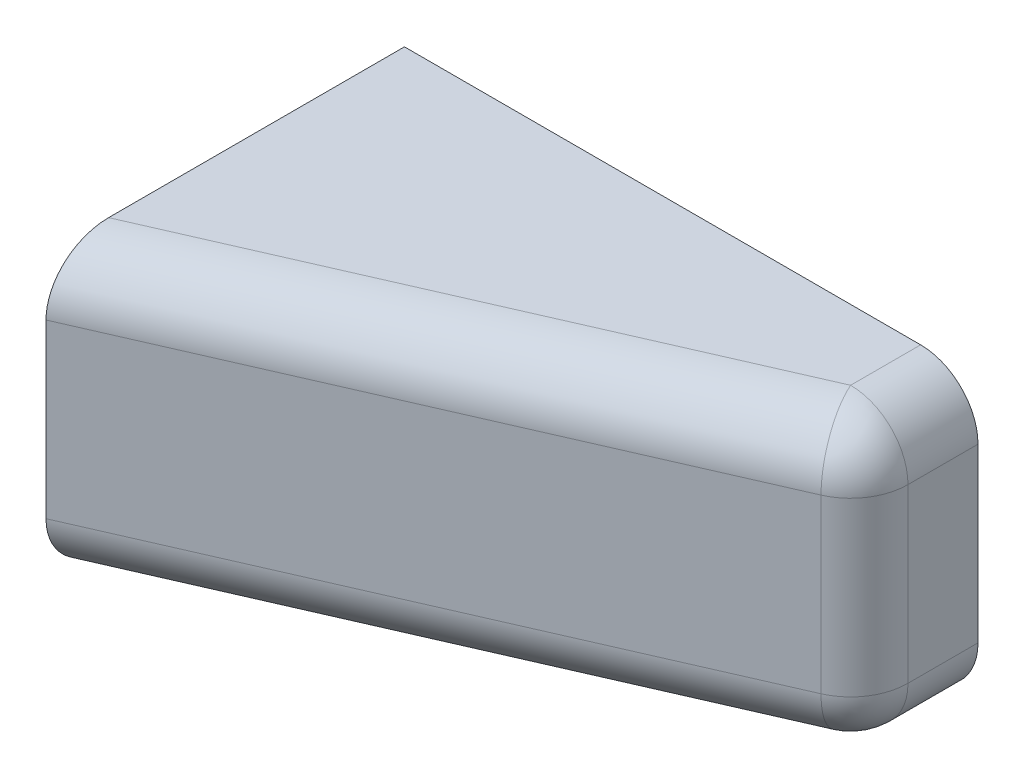
ISO-10303-21;
HEADER;
FILE_DESCRIPTION(('STEP AP214'),'2;1');
FILE_NAME('part.step','',(''),(''),'','','');
FILE_SCHEMA(('AUTOMOTIVE_DESIGN { 1 0 10303 214 1 1 1 1 }'));
ENDSEC;
DATA;
#1=APPLICATION_CONTEXT('core data for automotive mechanical design processes');
#2=APPLICATION_PROTOCOL_DEFINITION('international standard','automotive_design',2000,#1);
#3=PRODUCT_CONTEXT('',#1,'mechanical');
#4=PRODUCT('Part','Part','',(#3));
#5=PRODUCT_RELATED_PRODUCT_CATEGORY('part','',(#4));
#6=PRODUCT_DEFINITION_FORMATION('','',#4);
#7=PRODUCT_DEFINITION_CONTEXT('part definition',#1,'design');
#8=PRODUCT_DEFINITION('design','',#6,#7);
#9=PRODUCT_DEFINITION_SHAPE('','',#8);
#10=(LENGTH_UNIT() NAMED_UNIT(*) SI_UNIT(.MILLI.,.METRE.));
#11=(NAMED_UNIT(*) PLANE_ANGLE_UNIT() SI_UNIT($,.RADIAN.));
#12=(NAMED_UNIT(*) SI_UNIT($,.STERADIAN.) SOLID_ANGLE_UNIT());
#13=UNCERTAINTY_MEASURE_WITH_UNIT(LENGTH_MEASURE(1.E-05),#10,'distance_accuracy_value','');
#14=(GEOMETRIC_REPRESENTATION_CONTEXT(3) GLOBAL_UNCERTAINTY_ASSIGNED_CONTEXT((#13)) GLOBAL_UNIT_ASSIGNED_CONTEXT((#10,
#11,#12)) REPRESENTATION_CONTEXT('',''));
#15=CARTESIAN_POINT('',(0.,0.,0.));
#16=DIRECTION('',(0.,0.,1.));
#17=DIRECTION('',(1.,0.,0.));
#18=AXIS2_PLACEMENT_3D('',#15,#16,#17);
#19=CARTESIAN_POINT('',(0.,0.,5.));
#20=DIRECTION('',(0.,0.,1.));
#21=DIRECTION('',(1.,0.,0.));
#22=AXIS2_PLACEMENT_3D('',#19,#20,#21);
#23=PLANE('',#22);
#24=CARTESIAN_POINT('',(13.,10.,5.));
#25=DIRECTION('',(0.,0.,1.));
#26=DIRECTION('',(1.,0.,0.));
#27=AXIS2_PLACEMENT_3D('',#24,#25,#26);
#28=CIRCLE('',#27,1.6);
#29=CARTESIAN_POINT('',(14.6,10.,5.));
#30=VERTEX_POINT('',#29);
#31=EDGE_CURVE('E312',#30,#30,#28,.T.);
#32=ORIENTED_EDGE('',*,*,#31,.F.);
#33=EDGE_LOOP('',(#32));
#34=FACE_BOUND('',#33,.T.);
#35=CARTESIAN_POINT('',(34.,10.,5.));
#36=DIRECTION('',(0.,0.,1.));
#37=DIRECTION('',(1.,0.,0.));
#38=AXIS2_PLACEMENT_3D('',#35,#36,#37);
#39=CIRCLE('',#38,1.6);
#40=CARTESIAN_POINT('',(35.6,10.,5.));
#41=VERTEX_POINT('',#40);
#42=EDGE_CURVE('E306',#41,#41,#39,.T.);
#43=ORIENTED_EDGE('',*,*,#42,.F.);
#44=EDGE_LOOP('',(#43));
#45=FACE_BOUND('',#44,.T.);
#46=DIRECTION('',(1.,0.,0.));
#47=VECTOR('',#46,1.);
#48=CARTESIAN_POINT('',(35.5877132402715,12.75,5.));
#49=LINE('',#48,#47);
#50=CARTESIAN_POINT('',(10.5,12.75,5.));
#51=VERTEX_POINT('',#50);
#52=CARTESIAN_POINT('',(35.5877132402715,12.75,5.));
#53=VERTEX_POINT('',#52);
#54=EDGE_CURVE('E274',#51,#53,#49,.T.);
#55=ORIENTED_EDGE('',*,*,#54,.F.);
#56=DIRECTION('',(0.,-1.,0.));
#57=VECTOR('',#56,1.);
#58=CARTESIAN_POINT('',(10.5,0.,5.));
#59=LINE('',#58,#57);
#60=CARTESIAN_POINT('',(10.5,7.25,5.));
#61=VERTEX_POINT('',#60);
#62=EDGE_CURVE('E392',#51,#61,#59,.T.);
#63=ORIENTED_EDGE('',*,*,#62,.T.);
#64=DIRECTION('',(-1.,0.,0.));
#65=VECTOR('',#64,1.);
#66=CARTESIAN_POINT('',(35.5877132402715,7.25,5.));
#67=LINE('',#66,#65);
#68=CARTESIAN_POINT('',(35.5877132402715,7.25,5.));
#69=VERTEX_POINT('',#68);
#70=EDGE_CURVE('E278',#69,#61,#67,.T.);
#71=ORIENTED_EDGE('',*,*,#70,.F.);
#72=DIRECTION('',(-0.500000000000001,-0.866025403784438,0.));
#73=VECTOR('',#72,1.);
#74=CARTESIAN_POINT('',(35.5877132402715,7.25,5.));
#75=LINE('',#74,#73);
#76=CARTESIAN_POINT('',(37.1754264805429,10.,5.));
#77=VERTEX_POINT('',#76);
#78=EDGE_CURVE('E292',#77,#69,#75,.T.);
#79=ORIENTED_EDGE('',*,*,#78,.F.);
#80=DIRECTION('',(0.5,-0.866025403784438,0.));
#81=VECTOR('',#80,1.);
#82=CARTESIAN_POINT('',(36.3815698604072,11.375,5.));
#83=LINE('',#82,#81);
#84=EDGE_CURVE('E289',#53,#77,#83,.T.);
#85=ORIENTED_EDGE('',*,*,#84,.F.);
#86=EDGE_LOOP('',(#55,#63,#71,#79,#85));
#87=FACE_BOUND('',#86,.T.);
#88=ADVANCED_FACE('F37',(#34,#45,#87),#23,.T.);
#89=CARTESIAN_POINT('',(35.5877132402715,12.75,7.5));
#90=DIRECTION('',(0.,1.,0.));
#91=DIRECTION('',(0.,0.,1.));
#92=AXIS2_PLACEMENT_3D('',#89,#90,#91);
#93=PLANE('',#92);
#94=DIRECTION('',(1.,0.,0.));
#95=VECTOR('',#94,1.);
#96=CARTESIAN_POINT('',(35.5877132402715,12.75,7.5));
#97=LINE('',#96,#95);
#98=CARTESIAN_POINT('',(10.5,12.75,7.5));
#99=VERTEX_POINT('',#98);
#100=CARTESIAN_POINT('',(35.5877132402715,12.75,7.5));
#101=VERTEX_POINT('',#100);
#102=EDGE_CURVE('E275',#99,#101,#97,.T.);
#103=ORIENTED_EDGE('',*,*,#102,.F.);
#104=DIRECTION('',(0.,0.,-1.));
#105=VECTOR('',#104,1.);
#106=CARTESIAN_POINT('',(10.5,12.75,5.));
#107=LINE('',#106,#105);
#108=EDGE_CURVE('E389',#99,#51,#107,.T.);
#109=ORIENTED_EDGE('',*,*,#108,.T.);
#110=ORIENTED_EDGE('',*,*,#54,.T.);
#111=DIRECTION('',(0.,0.,-1.));
#112=VECTOR('',#111,1.);
#113=CARTESIAN_POINT('',(35.5877132402715,12.75,7.5));
#114=LINE('',#113,#112);
#115=EDGE_CURVE('E302',#101,#53,#114,.T.);
#116=ORIENTED_EDGE('',*,*,#115,.F.);
#117=EDGE_LOOP('',(#103,#109,#110,#116));
#118=FACE_BOUND('',#117,.T.);
#119=ADVANCED_FACE('F517',(#118),#93,.F.);
#120=CARTESIAN_POINT('',(35.5877132402715,7.25,7.5));
#121=DIRECTION('',(0.,-1.,0.));
#122=DIRECTION('',(1.,0.,0.));
#123=AXIS2_PLACEMENT_3D('',#120,#121,#122);
#124=PLANE('',#123);
#125=ORIENTED_EDGE('',*,*,#70,.T.);
#126=DIRECTION('',(0.,0.,1.));
#127=VECTOR('',#126,1.);
#128=CARTESIAN_POINT('',(10.5,7.25,7.5));
#129=LINE('',#128,#127);
#130=CARTESIAN_POINT('',(10.5,7.25,7.5));
#131=VERTEX_POINT('',#130);
#132=EDGE_CURVE('E394',#61,#131,#129,.T.);
#133=ORIENTED_EDGE('',*,*,#132,.T.);
#134=DIRECTION('',(-1.,0.,0.));
#135=VECTOR('',#134,1.);
#136=CARTESIAN_POINT('',(35.5877132402715,7.25,7.5));
#137=LINE('',#136,#135);
#138=CARTESIAN_POINT('',(35.5877132402715,7.25,7.5));
#139=VERTEX_POINT('',#138);
#140=EDGE_CURVE('E284',#139,#131,#137,.T.);
#141=ORIENTED_EDGE('',*,*,#140,.F.);
#142=DIRECTION('',(0.,0.,-1.));
#143=VECTOR('',#142,1.);
#144=CARTESIAN_POINT('',(35.5877132402715,7.25,7.5));
#145=LINE('',#144,#143);
#146=EDGE_CURVE('E287',#139,#69,#145,.T.);
#147=ORIENTED_EDGE('',*,*,#146,.T.);
#148=EDGE_LOOP('',(#125,#133,#141,#147));
#149=FACE_BOUND('',#148,.T.);
#150=ADVANCED_FACE('F523',(#149),#124,.F.);
#151=CARTESIAN_POINT('',(0.,0.,7.5));
#152=DIRECTION('',(0.,0.,-1.));
#153=DIRECTION('',(-1.,0.,0.));
#154=AXIS2_PLACEMENT_3D('',#151,#152,#153);
#155=PLANE('',#154);
#156=ORIENTED_EDGE('',*,*,#140,.T.);
#157=DIRECTION('',(0.,1.,0.));
#158=VECTOR('',#157,1.);
#159=CARTESIAN_POINT('',(10.5,0.,7.5));
#160=LINE('',#159,#158);
#161=EDGE_CURVE('E396',#131,#99,#160,.T.);
#162=ORIENTED_EDGE('',*,*,#161,.T.);
#163=ORIENTED_EDGE('',*,*,#102,.T.);
#164=DIRECTION('',(0.500000000000001,-0.866025403784438,0.));
#165=VECTOR('',#164,1.);
#166=CARTESIAN_POINT('',(35.5877132402715,12.75,7.5));
#167=LINE('',#166,#165);
#168=CARTESIAN_POINT('',(37.1754264805429,10.,7.5));
#169=VERTEX_POINT('',#168);
#170=EDGE_CURVE('E277',#101,#169,#167,.T.);
#171=ORIENTED_EDGE('',*,*,#170,.T.);
#172=DIRECTION('',(-0.5,-0.866025403784438,0.));
#173=VECTOR('',#172,1.);
#174=CARTESIAN_POINT('',(36.3815698604072,8.625,7.5));
#175=LINE('',#174,#173);
#176=EDGE_CURVE('E281',#169,#139,#175,.T.);
#177=ORIENTED_EDGE('',*,*,#176,.T.);
#178=EDGE_LOOP('',(#156,#162,#163,#171,#177));
#179=FACE_BOUND('',#178,.T.);
#180=ADVANCED_FACE('F535',(#179),#155,.T.);
#181=CARTESIAN_POINT('',(0.,0.,0.));
#182=DIRECTION('',(0.,0.,1.));
#183=DIRECTION('',(1.,0.,0.));
#184=AXIS2_PLACEMENT_3D('',#181,#182,#183);
#185=PLANE('',#184);
#186=DIRECTION('',(-1.,0.,0.));
#187=VECTOR('',#186,1.);
#188=CARTESIAN_POINT('',(2.5,6.,0.));
#189=LINE('',#188,#187);
#190=CARTESIAN_POINT('',(1.49999999999999,6.,0.));
#191=VERTEX_POINT('',#190);
#192=CARTESIAN_POINT('',(0.,6.,0.));
#193=VERTEX_POINT('',#192);
#194=EDGE_CURVE('E263',#191,#193,#189,.T.);
#195=ORIENTED_EDGE('',*,*,#194,.F.);
#196=DIRECTION('',(0.,-1.,0.));
#197=VECTOR('',#196,1.);
#198=CARTESIAN_POINT('',(1.49999999999999,4.,0.));
#199=LINE('',#198,#197);
#200=CARTESIAN_POINT('',(1.49999999999999,2.99999999999999,0.));
#201=VERTEX_POINT('',#200);
#202=EDGE_CURVE('E54',#191,#201,#199,.T.);
#203=ORIENTED_EDGE('',*,*,#202,.T.);
#204=DIRECTION('',(1.,0.,0.));
#205=VECTOR('',#204,1.);
#206=CARTESIAN_POINT('',(9.5,2.99999999999999,0.));
#207=LINE('',#206,#205);
#208=CARTESIAN_POINT('',(10.5,2.99999999999999,0.));
#209=VERTEX_POINT('',#208);
#210=EDGE_CURVE('E58',#201,#209,#207,.T.);
#211=ORIENTED_EDGE('',*,*,#210,.T.);
#212=DIRECTION('',(0.,1.,0.));
#213=VECTOR('',#212,1.);
#214=CARTESIAN_POINT('',(10.5,16.,0.));
#215=LINE('',#214,#213);
#216=CARTESIAN_POINT('',(10.5,17.,0.));
#217=VERTEX_POINT('',#216);
#218=EDGE_CURVE('E415',#209,#217,#215,.T.);
#219=ORIENTED_EDGE('',*,*,#218,.T.);
#220=DIRECTION('',(-1.,0.,0.));
#221=VECTOR('',#220,1.);
#222=CARTESIAN_POINT('',(0.,17.,0.));
#223=LINE('',#222,#221);
#224=CARTESIAN_POINT('',(1.49999999999999,17.,0.));
#225=VERTEX_POINT('',#224);
#226=EDGE_CURVE('E413',#217,#225,#223,.T.);
#227=ORIENTED_EDGE('',*,*,#226,.T.);
#228=DIRECTION('',(0.,-1.,0.));
#229=VECTOR('',#228,1.);
#230=CARTESIAN_POINT('',(1.49999999999999,14.,0.));
#231=LINE('',#230,#229);
#232=CARTESIAN_POINT('',(1.49999999999999,14.,0.));
#233=VERTEX_POINT('',#232);
#234=EDGE_CURVE('E418',#225,#233,#231,.T.);
#235=ORIENTED_EDGE('',*,*,#234,.T.);
#236=DIRECTION('',(-1.,0.,0.));
#237=VECTOR('',#236,1.);
#238=CARTESIAN_POINT('',(2.5,14.,0.));
#239=LINE('',#238,#237);
#240=CARTESIAN_POINT('',(0.,14.,0.));
#241=VERTEX_POINT('',#240);
#242=EDGE_CURVE('E264',#233,#241,#239,.T.);
#243=ORIENTED_EDGE('',*,*,#242,.T.);
#244=DIRECTION('',(0.,-1.,0.));
#245=VECTOR('',#244,1.);
#246=CARTESIAN_POINT('',(0.,20.,0.));
#247=LINE('',#246,#245);
#248=CARTESIAN_POINT('',(0.,20.,0.));
#249=VERTEX_POINT('',#248);
#250=EDGE_CURVE('E318',#249,#241,#247,.T.);
#251=ORIENTED_EDGE('',*,*,#250,.F.);
#252=DIRECTION('',(-1.,0.,0.));
#253=VECTOR('',#252,1.);
#254=CARTESIAN_POINT('',(40.,20.,0.));
#255=LINE('',#254,#253);
#256=CARTESIAN_POINT('',(36.,20.,0.));
#257=VERTEX_POINT('',#256);
#258=EDGE_CURVE('E327',#257,#249,#255,.T.);
#259=ORIENTED_EDGE('',*,*,#258,.F.);
#260=CARTESIAN_POINT('',(36.,16.,0.));
#261=DIRECTION('',(0.,0.,1.));
#262=DIRECTION('',(1.,0.,0.));
#263=AXIS2_PLACEMENT_3D('',#260,#261,#262);
#264=CIRCLE('',#263,4.);
#265=CARTESIAN_POINT('',(40.,16.,0.));
#266=VERTEX_POINT('',#265);
#267=EDGE_CURVE('E341',#257,#266,#264,.F.);
#268=ORIENTED_EDGE('',*,*,#267,.T.);
#269=DIRECTION('',(0.,1.,0.));
#270=VECTOR('',#269,1.);
#271=CARTESIAN_POINT('',(40.,0.,0.));
#272=LINE('',#271,#270);
#273=CARTESIAN_POINT('',(40.,4.,0.));
#274=VERTEX_POINT('',#273);
#275=EDGE_CURVE('E324',#274,#266,#272,.T.);
#276=ORIENTED_EDGE('',*,*,#275,.F.);
#277=CARTESIAN_POINT('',(36.,4.,0.));
#278=DIRECTION('',(0.,0.,1.));
#279=DIRECTION('',(1.,0.,0.));
#280=AXIS2_PLACEMENT_3D('',#277,#278,#279);
#281=CIRCLE('',#280,4.);
#282=CARTESIAN_POINT('',(36.,0.,0.));
#283=VERTEX_POINT('',#282);
#284=EDGE_CURVE('E343',#274,#283,#281,.F.);
#285=ORIENTED_EDGE('',*,*,#284,.T.);
#286=DIRECTION('',(1.,0.,0.));
#287=VECTOR('',#286,1.);
#288=CARTESIAN_POINT('',(0.,0.,0.));
#289=LINE('',#288,#287);
#290=CARTESIAN_POINT('',(0.,0.,0.));
#291=VERTEX_POINT('',#290);
#292=EDGE_CURVE('E321',#291,#283,#289,.T.);
#293=ORIENTED_EDGE('',*,*,#292,.F.);
#294=EDGE_CURVE('E315',#193,#291,#247,.T.);
#295=ORIENTED_EDGE('',*,*,#294,.F.);
#296=EDGE_LOOP('',(#195,#203,#211,#219,#227,#235,#243,#251,#259,#268,#276,#285,#293,#295));
#297=FACE_BOUND('',#296,.T.);
#298=CARTESIAN_POINT('',(34.,10.,0.));
#299=DIRECTION('',(0.,0.,1.));
#300=DIRECTION('',(1.,0.,0.));
#301=AXIS2_PLACEMENT_3D('',#298,#299,#300);
#302=CIRCLE('',#301,1.6);
#303=CARTESIAN_POINT('',(35.6,10.,0.));
#304=VERTEX_POINT('',#303);
#305=EDGE_CURVE('E305',#304,#304,#302,.T.);
#306=ORIENTED_EDGE('',*,*,#305,.T.);
#307=EDGE_LOOP('',(#306));
#308=FACE_BOUND('',#307,.T.);
#309=CARTESIAN_POINT('',(13.,10.,0.));
#310=DIRECTION('',(0.,0.,1.));
#311=DIRECTION('',(1.,0.,0.));
#312=AXIS2_PLACEMENT_3D('',#309,#310,#311);
#313=CIRCLE('',#312,1.6);
#314=CARTESIAN_POINT('',(14.6,10.,0.));
#315=VERTEX_POINT('',#314);
#316=EDGE_CURVE('E309',#315,#315,#313,.T.);
#317=ORIENTED_EDGE('',*,*,#316,.T.);
#318=EDGE_LOOP('',(#317));
#319=FACE_BOUND('',#318,.T.);
#320=ADVANCED_FACE('F461',(#297,#308,#319),#185,.F.);
#321=CARTESIAN_POINT('',(0.,20.,5.));
#322=DIRECTION('',(1.,0.,0.));
#323=DIRECTION('',(0.,0.,-1.));
#324=AXIS2_PLACEMENT_3D('',#321,#322,#323);
#325=PLANE('',#324);
#326=DIRECTION('',(0.,0.,-1.));
#327=VECTOR('',#326,1.);
#328=CARTESIAN_POINT('',(0.,0.,5.));
#329=LINE('',#328,#327);
#330=CARTESIAN_POINT('',(0.,0.,20.6339377008568));
#331=VERTEX_POINT('',#330);
#332=EDGE_CURVE('E332',#331,#291,#329,.T.);
#333=ORIENTED_EDGE('',*,*,#332,.F.);
#334=CARTESIAN_POINT('',(0.,4.,20.6339377008568));
#335=DIRECTION('',(1.,0.,0.));
#336=DIRECTION('',(0.,0.,1.));
#337=AXIS2_PLACEMENT_3D('',#334,#335,#336);
#338=ELLIPSE('',#337,4.36606229914325,4.);
#339=CARTESIAN_POINT('',(0.,4.,25.));
#340=VERTEX_POINT('',#339);
#341=EDGE_CURVE('E361',#331,#340,#338,.F.);
#342=ORIENTED_EDGE('',*,*,#341,.T.);
#343=DIRECTION('',(0.,1.,0.));
#344=VECTOR('',#343,1.);
#345=CARTESIAN_POINT('',(0.,0.,25.));
#346=LINE('',#345,#344);
#347=CARTESIAN_POINT('',(0.,16.,25.));
#348=VERTEX_POINT('',#347);
#349=EDGE_CURVE('E266',#340,#348,#346,.T.);
#350=ORIENTED_EDGE('',*,*,#349,.T.);
#351=CARTESIAN_POINT('',(0.,16.,20.6339377008568));
#352=DIRECTION('',(1.,0.,0.));
#353=DIRECTION('',(0.,0.,1.));
#354=AXIS2_PLACEMENT_3D('',#351,#352,#353);
#355=ELLIPSE('',#354,4.36606229914325,4.);
#356=CARTESIAN_POINT('',(0.,20.,20.6339377008568));
#357=VERTEX_POINT('',#356);
#358=EDGE_CURVE('E359',#348,#357,#355,.F.);
#359=ORIENTED_EDGE('',*,*,#358,.T.);
#360=DIRECTION('',(0.,0.,-1.));
#361=VECTOR('',#360,1.);
#362=CARTESIAN_POINT('',(0.,20.,5.));
#363=LINE('',#362,#361);
#364=EDGE_CURVE('E330',#357,#249,#363,.T.);
#365=ORIENTED_EDGE('',*,*,#364,.T.);
#366=ORIENTED_EDGE('',*,*,#250,.T.);
#367=DIRECTION('',(0.,0.,-1.));
#368=VECTOR('',#367,1.);
#369=CARTESIAN_POINT('',(0.,14.,14.));
#370=LINE('',#369,#368);
#371=CARTESIAN_POINT('',(0.,14.,14.));
#372=VERTEX_POINT('',#371);
#373=EDGE_CURVE('E260',#372,#241,#370,.T.);
#374=ORIENTED_EDGE('',*,*,#373,.F.);
#375=CARTESIAN_POINT('',(0.,10.,14.));
#376=DIRECTION('',(-1.,0.,0.));
#377=DIRECTION('',(0.,0.,1.));
#378=AXIS2_PLACEMENT_3D('',#375,#376,#377);
#379=CIRCLE('',#378,4.);
#380=CARTESIAN_POINT('',(0.,6.,14.));
#381=VERTEX_POINT('',#380);
#382=EDGE_CURVE('E257',#381,#372,#379,.T.);
#383=ORIENTED_EDGE('',*,*,#382,.F.);
#384=DIRECTION('',(0.,0.,1.));
#385=VECTOR('',#384,1.);
#386=CARTESIAN_POINT('',(0.,6.,0.));
#387=LINE('',#386,#385);
#388=EDGE_CURVE('E250',#193,#381,#387,.T.);
#389=ORIENTED_EDGE('',*,*,#388,.F.);
#390=ORIENTED_EDGE('',*,*,#294,.T.);
#391=EDGE_LOOP('',(#333,#342,#350,#359,#365,#366,#374,#383,#389,#390));
#392=FACE_BOUND('',#391,.T.);
#393=ADVANCED_FACE('F534',(#392),#325,.F.);
#394=CARTESIAN_POINT('',(0.,0.,5.));
#395=DIRECTION('',(0.,1.,0.));
#396=DIRECTION('',(0.,0.,1.));
#397=AXIS2_PLACEMENT_3D('',#394,#395,#396);
#398=PLANE('',#397);
#399=ORIENTED_EDGE('',*,*,#292,.T.);
#400=DIRECTION('',(0.,0.,-1.));
#401=VECTOR('',#400,1.);
#402=CARTESIAN_POINT('',(36.,0.,5.));
#403=LINE('',#402,#401);
#404=CARTESIAN_POINT('',(36.,0.,4.88393770085675));
#405=VERTEX_POINT('',#404);
#406=EDGE_CURVE('E347',#283,#405,#403,.F.);
#407=ORIENTED_EDGE('',*,*,#406,.T.);
#408=DIRECTION('',(0.916157334902189,0.,-0.400818834019708));
#409=VECTOR('',#408,1.);
#410=CARTESIAN_POINT('',(-1.60327533607884,0.,21.3353706603912));
#411=LINE('',#410,#409);
#412=EDGE_CURVE('E345',#405,#331,#411,.F.);
#413=ORIENTED_EDGE('',*,*,#412,.T.);
#414=ORIENTED_EDGE('',*,*,#332,.T.);
#415=EDGE_LOOP('',(#399,#407,#413,#414));
#416=FACE_BOUND('',#415,.T.);
#417=ADVANCED_FACE('F543',(#416),#398,.F.);
#418=CARTESIAN_POINT('',(40.,0.,5.));
#419=DIRECTION('',(-1.,0.,0.));
#420=DIRECTION('',(0.,-1.,0.));
#421=AXIS2_PLACEMENT_3D('',#418,#419,#420);
#422=PLANE('',#421);
#423=DIRECTION('',(0.,1.,0.));
#424=VECTOR('',#423,1.);
#425=CARTESIAN_POINT('',(40.,0.,4.88393770085675));
#426=LINE('',#425,#424);
#427=CARTESIAN_POINT('',(40.,16.,4.88393770085676));
#428=VERTEX_POINT('',#427);
#429=CARTESIAN_POINT('',(40.,4.,4.88393770085675));
#430=VERTEX_POINT('',#429);
#431=EDGE_CURVE('E334',#428,#430,#426,.F.);
#432=ORIENTED_EDGE('',*,*,#431,.T.);
#433=DIRECTION('',(0.,0.,-1.));
#434=VECTOR('',#433,1.);
#435=CARTESIAN_POINT('',(40.,4.,5.));
#436=LINE('',#435,#434);
#437=EDGE_CURVE('E338',#430,#274,#436,.T.);
#438=ORIENTED_EDGE('',*,*,#437,.T.);
#439=ORIENTED_EDGE('',*,*,#275,.T.);
#440=DIRECTION('',(0.,0.,-1.));
#441=VECTOR('',#440,1.);
#442=CARTESIAN_POINT('',(40.,16.,5.));
#443=LINE('',#442,#441);
#444=EDGE_CURVE('E336',#266,#428,#443,.F.);
#445=ORIENTED_EDGE('',*,*,#444,.T.);
#446=EDGE_LOOP('',(#432,#438,#439,#445));
#447=FACE_BOUND('',#446,.T.);
#448=ADVANCED_FACE('F539',(#447),#422,.F.);
#449=CARTESIAN_POINT('',(40.,20.,5.));
#450=DIRECTION('',(0.,-1.,0.));
#451=DIRECTION('',(0.,0.,-1.));
#452=AXIS2_PLACEMENT_3D('',#449,#450,#451);
#453=PLANE('',#452);
#454=DIRECTION('',(0.916157334902189,0.,-0.400818834019708));
#455=VECTOR('',#454,1.);
#456=CARTESIAN_POINT('',(38.3967246639212,20.,3.83537066039124));
#457=LINE('',#456,#455);
#458=CARTESIAN_POINT('',(36.,20.,4.88393770085676));
#459=VERTEX_POINT('',#458);
#460=EDGE_CURVE('E349',#357,#459,#457,.T.);
#461=ORIENTED_EDGE('',*,*,#460,.T.);
#462=DIRECTION('',(0.,0.,-1.));
#463=VECTOR('',#462,1.);
#464=CARTESIAN_POINT('',(36.,20.,5.));
#465=LINE('',#464,#463);
#466=EDGE_CURVE('E351',#459,#257,#465,.T.);
#467=ORIENTED_EDGE('',*,*,#466,.T.);
#468=ORIENTED_EDGE('',*,*,#258,.T.);
#469=ORIENTED_EDGE('',*,*,#364,.F.);
#470=EDGE_LOOP('',(#461,#467,#468,#469));
#471=FACE_BOUND('',#470,.T.);
#472=ADVANCED_FACE('F536',(#471),#453,.F.);
#473=CARTESIAN_POINT('',(13.,10.,5.));
#474=DIRECTION('',(0.,0.,-1.));
#475=DIRECTION('',(-1.,0.,0.));
#476=AXIS2_PLACEMENT_3D('',#473,#474,#475);
#477=CYLINDRICAL_SURFACE('',#476,1.6);
#478=ORIENTED_EDGE('',*,*,#31,.T.);
#479=EDGE_LOOP('',(#478));
#480=FACE_BOUND('',#479,.T.);
#481=ORIENTED_EDGE('',*,*,#316,.F.);
#482=EDGE_LOOP('',(#481));
#483=FACE_BOUND('',#482,.T.);
#484=ADVANCED_FACE('F530',(#480,#483),#477,.F.);
#485=CARTESIAN_POINT('',(34.,10.,5.));
#486=DIRECTION('',(0.,0.,-1.));
#487=DIRECTION('',(-1.,0.,0.));
#488=AXIS2_PLACEMENT_3D('',#485,#486,#487);
#489=CYLINDRICAL_SURFACE('',#488,1.6);
#490=ORIENTED_EDGE('',*,*,#42,.T.);
#491=EDGE_LOOP('',(#490));
#492=FACE_BOUND('',#491,.T.);
#493=ORIENTED_EDGE('',*,*,#305,.F.);
#494=EDGE_LOOP('',(#493));
#495=FACE_BOUND('',#494,.T.);
#496=ADVANCED_FACE('F766',(#492,#495),#489,.F.);
#497=CARTESIAN_POINT('',(36.3815698604072,11.375,7.5));
#498=DIRECTION('',(0.866025403784438,0.5,0.));
#499=DIRECTION('',(-0.5,0.866025403784438,0.));
#500=AXIS2_PLACEMENT_3D('',#497,#498,#499);
#501=PLANE('',#500);
#502=ORIENTED_EDGE('',*,*,#84,.T.);
#503=DIRECTION('',(0.,0.,-1.));
#504=VECTOR('',#503,1.);
#505=CARTESIAN_POINT('',(37.1754264805429,10.,7.5));
#506=LINE('',#505,#504);
#507=EDGE_CURVE('E299',#169,#77,#506,.T.);
#508=ORIENTED_EDGE('',*,*,#507,.F.);
#509=ORIENTED_EDGE('',*,*,#170,.F.);
#510=ORIENTED_EDGE('',*,*,#115,.T.);
#511=EDGE_LOOP('',(#502,#508,#509,#510));
#512=FACE_BOUND('',#511,.T.);
#513=ADVANCED_FACE('F763',(#512),#501,.F.);
#514=CARTESIAN_POINT('',(35.5877132402715,7.25,7.5));
#515=DIRECTION('',(0.866025403784438,-0.500000000000001,0.));
#516=DIRECTION('',(0.500000000000001,0.866025403784438,0.));
#517=AXIS2_PLACEMENT_3D('',#514,#515,#516);
#518=PLANE('',#517);
#519=ORIENTED_EDGE('',*,*,#78,.T.);
#520=ORIENTED_EDGE('',*,*,#146,.F.);
#521=ORIENTED_EDGE('',*,*,#176,.F.);
#522=ORIENTED_EDGE('',*,*,#507,.T.);
#523=EDGE_LOOP('',(#519,#520,#521,#522));
#524=FACE_BOUND('',#523,.T.);
#525=ADVANCED_FACE('F760',(#524),#518,.F.);
#526=CARTESIAN_POINT('',(40.,0.,7.5));
#527=DIRECTION('',(0.400818834019708,0.,0.916157334902189));
#528=DIRECTION('',(0.916157334902189,0.,-0.400818834019708));
#529=AXIS2_PLACEMENT_3D('',#526,#527,#528);
#530=PLANE('',#529);
#531=ORIENTED_EDGE('',*,*,#349,.F.);
#532=DIRECTION('',(0.916157334902189,0.,-0.400818834019708));
#533=VECTOR('',#532,1.);
#534=CARTESIAN_POINT('',(40.,4.,7.5));
#535=LINE('',#534,#533);
#536=CARTESIAN_POINT('',(37.6032753360788,4.,8.54856704046551));
#537=VERTEX_POINT('',#536);
#538=EDGE_CURVE('E357',#340,#537,#535,.T.);
#539=ORIENTED_EDGE('',*,*,#538,.T.);
#540=DIRECTION('',(0.,1.,0.));
#541=VECTOR('',#540,1.);
#542=CARTESIAN_POINT('',(37.6032753360788,20.,8.54856704046551));
#543=LINE('',#542,#541);
#544=CARTESIAN_POINT('',(37.6032753360788,16.,8.54856704046551));
#545=VERTEX_POINT('',#544);
#546=EDGE_CURVE('E355',#537,#545,#543,.T.);
#547=ORIENTED_EDGE('',*,*,#546,.T.);
#548=DIRECTION('',(0.916157334902189,0.,-0.400818834019708));
#549=VECTOR('',#548,1.);
#550=CARTESIAN_POINT('',(0.,16.,25.));
#551=LINE('',#550,#549);
#552=EDGE_CURVE('E353',#545,#348,#551,.F.);
#553=ORIENTED_EDGE('',*,*,#552,.T.);
#554=EDGE_LOOP('',(#531,#539,#547,#553));
#555=FACE_BOUND('',#554,.T.);
#556=ADVANCED_FACE('F714',(#555),#530,.T.);
#557=CARTESIAN_POINT('',(2.5,14.,14.));
#558=DIRECTION('',(0.,1.,0.));
#559=DIRECTION('',(0.,0.,1.));
#560=AXIS2_PLACEMENT_3D('',#557,#558,#559);
#561=PLANE('',#560);
#562=ORIENTED_EDGE('',*,*,#242,.F.);
#563=DIRECTION('',(0.,0.,1.));
#564=VECTOR('',#563,1.);
#565=CARTESIAN_POINT('',(1.49999999999999,14.,14.));
#566=LINE('',#565,#564);
#567=CARTESIAN_POINT('',(1.49999999999999,14.,14.));
#568=VERTEX_POINT('',#567);
#569=EDGE_CURVE('E421',#233,#568,#566,.T.);
#570=ORIENTED_EDGE('',*,*,#569,.T.);
#571=DIRECTION('',(-1.,0.,0.));
#572=VECTOR('',#571,1.);
#573=CARTESIAN_POINT('',(2.5,14.,14.));
#574=LINE('',#573,#572);
#575=EDGE_CURVE('E267',#568,#372,#574,.T.);
#576=ORIENTED_EDGE('',*,*,#575,.T.);
#577=ORIENTED_EDGE('',*,*,#373,.T.);
#578=EDGE_LOOP('',(#562,#570,#576,#577));
#579=FACE_BOUND('',#578,.T.);
#580=ADVANCED_FACE('F477',(#579),#561,.F.);
#581=CARTESIAN_POINT('',(2.5,10.,14.));
#582=DIRECTION('',(-1.,0.,0.));
#583=DIRECTION('',(0.,0.,1.));
#584=AXIS2_PLACEMENT_3D('',#581,#582,#583);
#585=CYLINDRICAL_SURFACE('',#584,4.);
#586=ORIENTED_EDGE('',*,*,#575,.F.);
#587=CARTESIAN_POINT('',(1.49999999999999,10.,14.));
#588=DIRECTION('',(1.,0.,0.));
#589=DIRECTION('',(0.,0.,-1.));
#590=AXIS2_PLACEMENT_3D('',#587,#588,#589);
#591=CIRCLE('',#590,4.);
#592=CARTESIAN_POINT('',(1.49999999999999,6.,14.));
#593=VERTEX_POINT('',#592);
#594=EDGE_CURVE('E408',#568,#593,#591,.T.);
#595=ORIENTED_EDGE('',*,*,#594,.T.);
#596=DIRECTION('',(-1.,0.,0.));
#597=VECTOR('',#596,1.);
#598=CARTESIAN_POINT('',(2.5,6.,14.));
#599=LINE('',#598,#597);
#600=EDGE_CURVE('E269',#593,#381,#599,.T.);
#601=ORIENTED_EDGE('',*,*,#600,.T.);
#602=ORIENTED_EDGE('',*,*,#382,.T.);
#603=EDGE_LOOP('',(#586,#595,#601,#602));
#604=FACE_BOUND('',#603,.T.);
#605=ADVANCED_FACE('F480',(#604),#585,.F.);
#606=CARTESIAN_POINT('',(2.5,6.,0.));
#607=DIRECTION('',(0.,-1.,0.));
#608=DIRECTION('',(0.,0.,-1.));
#609=AXIS2_PLACEMENT_3D('',#606,#607,#608);
#610=PLANE('',#609);
#611=ORIENTED_EDGE('',*,*,#600,.F.);
#612=DIRECTION('',(0.,0.,-1.));
#613=VECTOR('',#612,1.);
#614=CARTESIAN_POINT('',(1.49999999999999,6.,0.));
#615=LINE('',#614,#613);
#616=EDGE_CURVE('E411',#593,#191,#615,.T.);
#617=ORIENTED_EDGE('',*,*,#616,.T.);
#618=ORIENTED_EDGE('',*,*,#194,.T.);
#619=ORIENTED_EDGE('',*,*,#388,.T.);
#620=EDGE_LOOP('',(#611,#617,#618,#619));
#621=FACE_BOUND('',#620,.T.);
#622=ADVANCED_FACE('F494',(#621),#610,.F.);
#623=CARTESIAN_POINT('',(2.5,14.,20.));
#624=DIRECTION('',(1.,0.,0.));
#625=DIRECTION('',(0.,0.,-1.));
#626=AXIS2_PLACEMENT_3D('',#623,#624,#625);
#627=PLANE('',#626);
#628=DIRECTION('',(0.,0.,-1.));
#629=VECTOR('',#628,1.);
#630=CARTESIAN_POINT('',(2.5,4.,20.));
#631=LINE('',#630,#629);
#632=CARTESIAN_POINT('',(2.5,4.,20.));
#633=VERTEX_POINT('',#632);
#634=CARTESIAN_POINT('',(2.5,4.,1.00000000000001));
#635=VERTEX_POINT('',#634);
#636=EDGE_CURVE('E248',#633,#635,#631,.T.);
#637=ORIENTED_EDGE('',*,*,#636,.T.);
#638=DIRECTION('',(0.,1.,0.));
#639=VECTOR('',#638,1.);
#640=CARTESIAN_POINT('',(2.5,6.,1.00000000000001));
#641=LINE('',#640,#639);
#642=CARTESIAN_POINT('',(2.5,4.99999999999999,1.00000000000001));
#643=VERTEX_POINT('',#642);
#644=EDGE_CURVE('E406',#635,#643,#641,.T.);
#645=ORIENTED_EDGE('',*,*,#644,.T.);
#646=DIRECTION('',(0.,0.,1.));
#647=VECTOR('',#646,1.);
#648=CARTESIAN_POINT('',(2.5,4.99999999999999,14.));
#649=LINE('',#648,#647);
#650=CARTESIAN_POINT('',(2.5,4.99999999999999,14.));
#651=VERTEX_POINT('',#650);
#652=EDGE_CURVE('E404',#643,#651,#649,.T.);
#653=ORIENTED_EDGE('',*,*,#652,.T.);
#654=CARTESIAN_POINT('',(2.5,10.,14.));
#655=DIRECTION('',(1.,0.,0.));
#656=DIRECTION('',(0.,0.,-1.));
#657=AXIS2_PLACEMENT_3D('',#654,#655,#656);
#658=CIRCLE('',#657,5.00000000000001);
#659=CARTESIAN_POINT('',(2.5,15.,14.));
#660=VERTEX_POINT('',#659);
#661=EDGE_CURVE('E401',#651,#660,#658,.F.);
#662=ORIENTED_EDGE('',*,*,#661,.T.);
#663=DIRECTION('',(0.,0.,-1.));
#664=VECTOR('',#663,1.);
#665=CARTESIAN_POINT('',(2.5,15.,0.));
#666=LINE('',#665,#664);
#667=CARTESIAN_POINT('',(2.5,15.,1.00000000000001));
#668=VERTEX_POINT('',#667);
#669=EDGE_CURVE('E399',#660,#668,#666,.T.);
#670=ORIENTED_EDGE('',*,*,#669,.T.);
#671=DIRECTION('',(0.,1.,0.));
#672=VECTOR('',#671,1.);
#673=CARTESIAN_POINT('',(2.5,16.,1.00000000000001));
#674=LINE('',#673,#672);
#675=CARTESIAN_POINT('',(2.5,16.,1.00000000000001));
#676=VERTEX_POINT('',#675);
#677=EDGE_CURVE('E223',#668,#676,#674,.T.);
#678=ORIENTED_EDGE('',*,*,#677,.T.);
#679=DIRECTION('',(0.,0.,-1.));
#680=VECTOR('',#679,1.);
#681=CARTESIAN_POINT('',(2.5,16.,20.));
#682=LINE('',#681,#680);
#683=CARTESIAN_POINT('',(2.5,16.,20.));
#684=VERTEX_POINT('',#683);
#685=EDGE_CURVE('E215',#684,#676,#682,.T.);
#686=ORIENTED_EDGE('',*,*,#685,.F.);
#687=DIRECTION('',(0.,1.,0.));
#688=VECTOR('',#687,1.);
#689=CARTESIAN_POINT('',(2.5,14.,20.));
#690=LINE('',#689,#688);
#691=EDGE_CURVE('E220',#633,#684,#690,.T.);
#692=ORIENTED_EDGE('',*,*,#691,.F.);
#693=EDGE_LOOP('',(#637,#645,#653,#662,#670,#678,#686,#692));
#694=FACE_BOUND('',#693,.T.);
#695=ADVANCED_FACE('F218',(#694),#627,.T.);
#696=CARTESIAN_POINT('',(2.5,4.,20.));
#697=DIRECTION('',(0.,1.,0.));
#698=DIRECTION('',(0.,0.,1.));
#699=AXIS2_PLACEMENT_3D('',#696,#697,#698);
#700=PLANE('',#699);
#701=DIRECTION('',(0.,0.,-1.));
#702=VECTOR('',#701,1.);
#703=CARTESIAN_POINT('',(9.5,4.,20.));
#704=LINE('',#703,#702);
#705=CARTESIAN_POINT('',(9.5,4.,20.));
#706=VERTEX_POINT('',#705);
#707=CARTESIAN_POINT('',(9.5,4.,1.00000000000001));
#708=VERTEX_POINT('',#707);
#709=EDGE_CURVE('E251',#706,#708,#704,.T.);
#710=ORIENTED_EDGE('',*,*,#709,.T.);
#711=DIRECTION('',(-1.,0.,0.));
#712=VECTOR('',#711,1.);
#713=CARTESIAN_POINT('',(2.5,4.,1.00000000000001));
#714=LINE('',#713,#712);
#715=EDGE_CURVE('E46',#708,#635,#714,.T.);
#716=ORIENTED_EDGE('',*,*,#715,.T.);
#717=ORIENTED_EDGE('',*,*,#636,.F.);
#718=DIRECTION('',(1.,0.,0.));
#719=VECTOR('',#718,1.);
#720=CARTESIAN_POINT('',(2.5,4.,20.));
#721=LINE('',#720,#719);
#722=EDGE_CURVE('E227',#633,#706,#721,.T.);
#723=ORIENTED_EDGE('',*,*,#722,.T.);
#724=EDGE_LOOP('',(#710,#716,#717,#723));
#725=FACE_BOUND('',#724,.T.);
#726=ADVANCED_FACE('F503',(#725),#700,.T.);
#727=CARTESIAN_POINT('',(9.5,4.,20.));
#728=DIRECTION('',(-1.,0.,0.));
#729=DIRECTION('',(0.,0.,1.));
#730=AXIS2_PLACEMENT_3D('',#727,#728,#729);
#731=PLANE('',#730);
#732=DIRECTION('',(0.,1.,0.));
#733=VECTOR('',#732,1.);
#734=CARTESIAN_POINT('',(9.5,4.,3.99999999999999));
#735=LINE('',#734,#733);
#736=CARTESIAN_POINT('',(9.5,6.24999999999999,3.99999999999999));
#737=VERTEX_POINT('',#736);
#738=CARTESIAN_POINT('',(9.5,13.75,3.99999999999999));
#739=VERTEX_POINT('',#738);
#740=EDGE_CURVE('E384',#737,#739,#735,.T.);
#741=ORIENTED_EDGE('',*,*,#740,.T.);
#742=DIRECTION('',(0.,0.,1.));
#743=VECTOR('',#742,1.);
#744=CARTESIAN_POINT('',(9.5,13.75,7.5));
#745=LINE('',#744,#743);
#746=CARTESIAN_POINT('',(9.5,13.75,8.50000000000001));
#747=VERTEX_POINT('',#746);
#748=EDGE_CURVE('E386',#739,#747,#745,.T.);
#749=ORIENTED_EDGE('',*,*,#748,.T.);
#750=DIRECTION('',(0.,-1.,0.));
#751=VECTOR('',#750,1.);
#752=CARTESIAN_POINT('',(9.5,4.,8.50000000000001));
#753=LINE('',#752,#751);
#754=CARTESIAN_POINT('',(9.5,6.24999999999999,8.50000000000001));
#755=VERTEX_POINT('',#754);
#756=EDGE_CURVE('E380',#747,#755,#753,.T.);
#757=ORIENTED_EDGE('',*,*,#756,.T.);
#758=DIRECTION('',(0.,0.,-1.));
#759=VECTOR('',#758,1.);
#760=CARTESIAN_POINT('',(9.5,6.24999999999999,5.));
#761=LINE('',#760,#759);
#762=EDGE_CURVE('E382',#755,#737,#761,.T.);
#763=ORIENTED_EDGE('',*,*,#762,.T.);
#764=EDGE_LOOP('',(#741,#749,#757,#763));
#765=FACE_BOUND('',#764,.T.);
#766=DIRECTION('',(0.,0.,-1.));
#767=VECTOR('',#766,1.);
#768=CARTESIAN_POINT('',(9.5,16.,20.));
#769=LINE('',#768,#767);
#770=CARTESIAN_POINT('',(9.5,16.,20.));
#771=VERTEX_POINT('',#770);
#772=CARTESIAN_POINT('',(9.5,16.,1.00000000000001));
#773=VERTEX_POINT('',#772);
#774=EDGE_CURVE('E226',#771,#773,#769,.T.);
#775=ORIENTED_EDGE('',*,*,#774,.T.);
#776=DIRECTION('',(0.,-1.,0.));
#777=VECTOR('',#776,1.);
#778=CARTESIAN_POINT('',(9.5,4.,1.00000000000001));
#779=LINE('',#778,#777);
#780=EDGE_CURVE('E363',#773,#708,#779,.T.);
#781=ORIENTED_EDGE('',*,*,#780,.T.);
#782=ORIENTED_EDGE('',*,*,#709,.F.);
#783=DIRECTION('',(0.,1.,0.));
#784=VECTOR('',#783,1.);
#785=CARTESIAN_POINT('',(9.5,4.,20.));
#786=LINE('',#785,#784);
#787=EDGE_CURVE('E236',#706,#771,#786,.T.);
#788=ORIENTED_EDGE('',*,*,#787,.T.);
#789=EDGE_LOOP('',(#775,#781,#782,#788));
#790=FACE_BOUND('',#789,.T.);
#791=ADVANCED_FACE('F506',(#765,#790),#731,.T.);
#792=CARTESIAN_POINT('',(2.5,16.,20.));
#793=DIRECTION('',(0.,1.,0.));
#794=DIRECTION('',(0.,0.,1.));
#795=AXIS2_PLACEMENT_3D('',#792,#793,#794);
#796=PLANE('',#795);
#797=ORIENTED_EDGE('',*,*,#685,.T.);
#798=DIRECTION('',(1.,0.,0.));
#799=VECTOR('',#798,1.);
#800=CARTESIAN_POINT('',(2.5,16.,1.00000000000001));
#801=LINE('',#800,#799);
#802=EDGE_CURVE('E11',#676,#773,#801,.T.);
#803=ORIENTED_EDGE('',*,*,#802,.T.);
#804=ORIENTED_EDGE('',*,*,#774,.F.);
#805=DIRECTION('',(1.,0.,0.));
#806=VECTOR('',#805,1.);
#807=CARTESIAN_POINT('',(2.5,16.,20.));
#808=LINE('',#807,#806);
#809=EDGE_CURVE('E231',#684,#771,#808,.T.);
#810=ORIENTED_EDGE('',*,*,#809,.F.);
#811=EDGE_LOOP('',(#797,#803,#804,#810));
#812=FACE_BOUND('',#811,.T.);
#813=ADVANCED_FACE('F232',(#812),#796,.F.);
#814=CARTESIAN_POINT('',(0.,0.,20.));
#815=DIRECTION('',(0.,0.,-1.));
#816=DIRECTION('',(-1.,0.,0.));
#817=AXIS2_PLACEMENT_3D('',#814,#815,#816);
#818=PLANE('',#817);
#819=ORIENTED_EDGE('',*,*,#691,.T.);
#820=ORIENTED_EDGE('',*,*,#809,.T.);
#821=ORIENTED_EDGE('',*,*,#787,.F.);
#822=ORIENTED_EDGE('',*,*,#722,.F.);
#823=EDGE_LOOP('',(#819,#820,#821,#822));
#824=FACE_BOUND('',#823,.T.);
#825=ADVANCED_FACE('F239',(#824),#818,.T.);
#826=CARTESIAN_POINT('',(39.3147574508064,16.,3.43373131612895));
#827=DIRECTION('',(-0.916157334902189,0.,0.400818834019708));
#828=DIRECTION('',(0.400818834019708,0.,0.916157334902189));
#829=AXIS2_PLACEMENT_3D('',#826,#827,#828);
#830=CYLINDRICAL_SURFACE('',#829,4.);
#831=ORIENTED_EDGE('',*,*,#358,.F.);
#832=ORIENTED_EDGE('',*,*,#552,.F.);
#833=CARTESIAN_POINT('',(36.,16.,4.88393770085676));
#834=DIRECTION('',(0.916157334902189,0.,-0.400818834019708));
#835=DIRECTION('',(-0.400818834019708,0.,-0.916157334902189));
#836=AXIS2_PLACEMENT_3D('',#833,#834,#835);
#837=CIRCLE('',#836,4.);
#838=EDGE_CURVE('E240',#459,#545,#837,.T.);
#839=ORIENTED_EDGE('',*,*,#838,.F.);
#840=ORIENTED_EDGE('',*,*,#460,.F.);
#841=EDGE_LOOP('',(#831,#832,#839,#840));
#842=FACE_BOUND('',#841,.T.);
#843=ADVANCED_FACE('F575',(#842),#830,.T.);
#844=CARTESIAN_POINT('',(36.,16.,5.));
#845=DIRECTION('',(0.,0.,-1.));
#846=DIRECTION('',(-1.,0.,0.));
#847=AXIS2_PLACEMENT_3D('',#844,#845,#846);
#848=CYLINDRICAL_SURFACE('',#847,4.);
#849=ORIENTED_EDGE('',*,*,#267,.F.);
#850=ORIENTED_EDGE('',*,*,#466,.F.);
#851=CARTESIAN_POINT('',(36.,16.,4.88393770085676));
#852=DIRECTION('',(0.,0.,1.));
#853=DIRECTION('',(0.,-1.,0.));
#854=AXIS2_PLACEMENT_3D('',#851,#852,#853);
#855=CIRCLE('',#854,4.);
#856=EDGE_CURVE('E243',#428,#459,#855,.T.);
#857=ORIENTED_EDGE('',*,*,#856,.F.);
#858=ORIENTED_EDGE('',*,*,#444,.F.);
#859=EDGE_LOOP('',(#849,#850,#857,#858));
#860=FACE_BOUND('',#859,.T.);
#861=ADVANCED_FACE('F571',(#860),#848,.T.);
#862=CARTESIAN_POINT('',(36.,16.,4.88393770085676));
#863=DIRECTION('',(0.,0.,1.));
#864=DIRECTION('',(1.,0.,0.));
#865=AXIS2_PLACEMENT_3D('',#862,#863,#864);
#866=SPHERICAL_SURFACE('',#865,4.);
#867=ORIENTED_EDGE('',*,*,#856,.T.);
#868=ORIENTED_EDGE('',*,*,#838,.T.);
#869=CARTESIAN_POINT('',(36.,16.,4.88393770085675));
#870=DIRECTION('',(0.,1.,0.));
#871=DIRECTION('',(0.,0.,1.));
#872=AXIS2_PLACEMENT_3D('',#869,#870,#871);
#873=CIRCLE('',#872,4.);
#874=EDGE_CURVE('E374',#428,#545,#873,.F.);
#875=ORIENTED_EDGE('',*,*,#874,.F.);
#876=EDGE_LOOP('',(#867,#868,#875));
#877=FACE_BOUND('',#876,.T.);
#878=ADVANCED_FACE('F567',(#877),#866,.T.);
#879=CARTESIAN_POINT('',(38.3967246639212,4.,3.83537066039124));
#880=DIRECTION('',(-0.916157334902189,0.,0.400818834019708));
#881=DIRECTION('',(0.400818834019708,0.,0.916157334902189));
#882=AXIS2_PLACEMENT_3D('',#879,#880,#881);
#883=CYLINDRICAL_SURFACE('',#882,4.);
#884=ORIENTED_EDGE('',*,*,#341,.F.);
#885=ORIENTED_EDGE('',*,*,#412,.F.);
#886=CARTESIAN_POINT('',(36.,4.,4.88393770085675));
#887=DIRECTION('',(0.916157334902189,0.,-0.400818834019708));
#888=DIRECTION('',(-0.400818834019708,0.,-0.916157334902189));
#889=AXIS2_PLACEMENT_3D('',#886,#887,#888);
#890=CIRCLE('',#889,4.);
#891=EDGE_CURVE('E371',#537,#405,#890,.T.);
#892=ORIENTED_EDGE('',*,*,#891,.F.);
#893=ORIENTED_EDGE('',*,*,#538,.F.);
#894=EDGE_LOOP('',(#884,#885,#892,#893));
#895=FACE_BOUND('',#894,.T.);
#896=ADVANCED_FACE('F563',(#895),#883,.T.);
#897=CARTESIAN_POINT('',(36.,0.,4.88393770085675));
#898=DIRECTION('',(0.,-1.,0.));
#899=DIRECTION('',(1.,0.,0.));
#900=AXIS2_PLACEMENT_3D('',#897,#898,#899);
#901=CYLINDRICAL_SURFACE('',#900,4.);
#902=ORIENTED_EDGE('',*,*,#874,.T.);
#903=ORIENTED_EDGE('',*,*,#546,.F.);
#904=CARTESIAN_POINT('',(36.,4.,4.88393770085675));
#905=DIRECTION('',(0.,-1.,0.));
#906=DIRECTION('',(1.,0.,0.));
#907=AXIS2_PLACEMENT_3D('',#904,#905,#906);
#908=CIRCLE('',#907,4.);
#909=EDGE_CURVE('E367',#430,#537,#908,.T.);
#910=ORIENTED_EDGE('',*,*,#909,.F.);
#911=ORIENTED_EDGE('',*,*,#431,.F.);
#912=EDGE_LOOP('',(#902,#903,#910,#911));
#913=FACE_BOUND('',#912,.T.);
#914=ADVANCED_FACE('F559',(#913),#901,.T.);
#915=CARTESIAN_POINT('',(36.,4.,4.88393770085675));
#916=DIRECTION('',(0.,0.,1.));
#917=DIRECTION('',(1.,0.,0.));
#918=AXIS2_PLACEMENT_3D('',#915,#916,#917);
#919=SPHERICAL_SURFACE('',#918,4.);
#920=ORIENTED_EDGE('',*,*,#909,.T.);
#921=ORIENTED_EDGE('',*,*,#891,.T.);
#922=CARTESIAN_POINT('',(36.,4.,4.88393770085675));
#923=DIRECTION('',(0.,0.,1.));
#924=DIRECTION('',(1.,0.,0.));
#925=AXIS2_PLACEMENT_3D('',#922,#923,#924);
#926=CIRCLE('',#925,4.);
#927=EDGE_CURVE('E364',#430,#405,#926,.F.);
#928=ORIENTED_EDGE('',*,*,#927,.F.);
#929=EDGE_LOOP('',(#920,#921,#928));
#930=FACE_BOUND('',#929,.T.);
#931=ADVANCED_FACE('F555',(#930),#919,.T.);
#932=CARTESIAN_POINT('',(36.,4.,5.));
#933=DIRECTION('',(0.,0.,-1.));
#934=DIRECTION('',(-1.,0.,0.));
#935=AXIS2_PLACEMENT_3D('',#932,#933,#934);
#936=CYLINDRICAL_SURFACE('',#935,4.);
#937=ORIENTED_EDGE('',*,*,#927,.T.);
#938=ORIENTED_EDGE('',*,*,#406,.F.);
#939=ORIENTED_EDGE('',*,*,#284,.F.);
#940=ORIENTED_EDGE('',*,*,#437,.F.);
#941=EDGE_LOOP('',(#937,#938,#939,#940));
#942=FACE_BOUND('',#941,.T.);
#943=ADVANCED_FACE('F551',(#942),#936,.T.);
#944=CARTESIAN_POINT('',(9.5,6.24999999999999,20.));
#945=DIRECTION('',(-0.70710678118655,0.707106781186545,0.));
#946=DIRECTION('',(0.,0.,1.));
#947=AXIS2_PLACEMENT_3D('',#944,#945,#946);
#948=PLANE('',#947);
#949=DIRECTION('',(0.577350269189623,0.577350269189627,-0.577350269189627));
#950=VECTOR('',#949,1.);
#951=CARTESIAN_POINT('',(5.66666666666667,2.41666666666664,12.3333333333334));
#952=LINE('',#951,#950);
#953=EDGE_CURVE('E428',#131,#755,#952,.F.);
#954=ORIENTED_EDGE('',*,*,#953,.F.);
#955=ORIENTED_EDGE('',*,*,#132,.F.);
#956=DIRECTION('',(0.577350269189624,0.577350269189627,0.577350269189627));
#957=VECTOR('',#956,1.);
#958=CARTESIAN_POINT('',(8.08333333333334,4.83333333333332,2.58333333333332));
#959=LINE('',#958,#957);
#960=EDGE_CURVE('E368',#737,#61,#959,.T.);
#961=ORIENTED_EDGE('',*,*,#960,.F.);
#962=ORIENTED_EDGE('',*,*,#762,.F.);
#963=EDGE_LOOP('',(#954,#955,#961,#962));
#964=FACE_BOUND('',#963,.T.);
#965=ADVANCED_FACE('F554',(#964),#948,.T.);
#966=CARTESIAN_POINT('',(10.5,0.,5.));
#967=DIRECTION('',(0.70710678118655,0.,-0.707106781186545));
#968=DIRECTION('',(0.,-1.,0.));
#969=AXIS2_PLACEMENT_3D('',#966,#967,#968);
#970=PLANE('',#969);
#971=ORIENTED_EDGE('',*,*,#960,.T.);
#972=ORIENTED_EDGE('',*,*,#62,.F.);
#973=DIRECTION('',(0.577350269189624,-0.577350269189627,0.577350269189627));
#974=VECTOR('',#973,1.);
#975=CARTESIAN_POINT('',(14.8333333333333,8.41666666666665,9.33333333333335));
#976=LINE('',#975,#974);
#977=EDGE_CURVE('E426',#739,#51,#976,.T.);
#978=ORIENTED_EDGE('',*,*,#977,.F.);
#979=ORIENTED_EDGE('',*,*,#740,.F.);
#980=EDGE_LOOP('',(#971,#972,#978,#979));
#981=FACE_BOUND('',#980,.T.);
#982=ADVANCED_FACE('F587',(#981),#970,.F.);
#983=CARTESIAN_POINT('',(10.5,0.,7.5));
#984=DIRECTION('',(0.70710678118655,0.,0.707106781186545));
#985=DIRECTION('',(0.,1.,0.));
#986=AXIS2_PLACEMENT_3D('',#983,#984,#985);
#987=PLANE('',#986);
#988=ORIENTED_EDGE('',*,*,#953,.T.);
#989=ORIENTED_EDGE('',*,*,#756,.F.);
#990=DIRECTION('',(-0.577350269189624,0.577350269189627,0.577350269189628));
#991=VECTOR('',#990,1.);
#992=CARTESIAN_POINT('',(5.66666666666667,17.5833333333334,12.3333333333334));
#993=LINE('',#992,#991);
#994=EDGE_CURVE('E424',#99,#747,#993,.T.);
#995=ORIENTED_EDGE('',*,*,#994,.F.);
#996=ORIENTED_EDGE('',*,*,#161,.F.);
#997=EDGE_LOOP('',(#988,#989,#995,#996));
#998=FACE_BOUND('',#997,.T.);
#999=ADVANCED_FACE('F583',(#998),#987,.F.);
#1000=CARTESIAN_POINT('',(9.5,13.75,20.));
#1001=DIRECTION('',(-0.707106781186549,-0.707106781186546,0.));
#1002=DIRECTION('',(0.,0.,-1.));
#1003=AXIS2_PLACEMENT_3D('',#1000,#1001,#1002);
#1004=PLANE('',#1003);
#1005=ORIENTED_EDGE('',*,*,#977,.T.);
#1006=ORIENTED_EDGE('',*,*,#108,.F.);
#1007=ORIENTED_EDGE('',*,*,#994,.T.);
#1008=ORIENTED_EDGE('',*,*,#748,.F.);
#1009=EDGE_LOOP('',(#1005,#1006,#1007,#1008));
#1010=FACE_BOUND('',#1009,.T.);
#1011=ADVANCED_FACE('F580',(#1010),#1004,.T.);
#1012=CARTESIAN_POINT('',(10.5,0.,0.));
#1013=DIRECTION('',(-0.707106781186545,0.,-0.70710678118655));
#1014=DIRECTION('',(0.,-1.,0.));
#1015=AXIS2_PLACEMENT_3D('',#1012,#1013,#1014);
#1016=PLANE('',#1015);
#1017=DIRECTION('',(0.577350269189627,0.577350269189627,-0.577350269189623));
#1018=VECTOR('',#1017,1.);
#1019=CARTESIAN_POINT('',(4.83333333333332,11.3333333333333,5.66666666666666));
#1020=LINE('',#1019,#1018);
#1021=EDGE_CURVE('E448',#217,#773,#1020,.F.);
#1022=ORIENTED_EDGE('',*,*,#1021,.F.);
#1023=ORIENTED_EDGE('',*,*,#218,.F.);
#1024=DIRECTION('',(-0.577350269189627,0.577350269189627,0.577350269189623));
#1025=VECTOR('',#1024,1.);
#1026=CARTESIAN_POINT('',(6.99999999999999,6.50000000000001,3.5));
#1027=LINE('',#1026,#1025);
#1028=EDGE_CURVE('E41',#708,#209,#1027,.F.);
#1029=ORIENTED_EDGE('',*,*,#1028,.F.);
#1030=ORIENTED_EDGE('',*,*,#780,.F.);
#1031=EDGE_LOOP('',(#1022,#1023,#1029,#1030));
#1032=FACE_BOUND('',#1031,.T.);
#1033=ADVANCED_FACE('F39',(#1032),#1016,.T.);
#1034=CARTESIAN_POINT('',(0.,2.99999999999999,0.));
#1035=DIRECTION('',(0.,0.707106781186545,-0.70710678118655));
#1036=DIRECTION('',(-1.,0.,0.));
#1037=AXIS2_PLACEMENT_3D('',#1034,#1035,#1036);
#1038=PLANE('',#1037);
#1039=ORIENTED_EDGE('',*,*,#1028,.T.);
#1040=ORIENTED_EDGE('',*,*,#210,.F.);
#1041=DIRECTION('',(0.577350269189627,0.577350269189627,0.577350269189623));
#1042=VECTOR('',#1041,1.);
#1043=CARTESIAN_POINT('',(0.499999999999985,1.99999999999999,-0.999999999999993));
#1044=LINE('',#1043,#1042);
#1045=EDGE_CURVE('E446',#635,#201,#1044,.F.);
#1046=ORIENTED_EDGE('',*,*,#1045,.F.);
#1047=ORIENTED_EDGE('',*,*,#715,.F.);
#1048=EDGE_LOOP('',(#1039,#1040,#1046,#1047));
#1049=FACE_BOUND('',#1048,.T.);
#1050=ADVANCED_FACE('F457',(#1049),#1038,.T.);
#1051=CARTESIAN_POINT('',(2.5,16.,1.00000000000001));
#1052=DIRECTION('',(0.,0.707106781186545,0.70710678118655));
#1053=DIRECTION('',(1.,0.,0.));
#1054=AXIS2_PLACEMENT_3D('',#1051,#1052,#1053);
#1055=PLANE('',#1054);
#1056=ORIENTED_EDGE('',*,*,#1021,.T.);
#1057=ORIENTED_EDGE('',*,*,#802,.F.);
#1058=DIRECTION('',(0.577350269189627,-0.577350269189627,0.577350269189623));
#1059=VECTOR('',#1058,1.);
#1060=CARTESIAN_POINT('',(7.16666666666668,11.3333333333333,5.66666666666666));
#1061=LINE('',#1060,#1059);
#1062=EDGE_CURVE('E443',#225,#676,#1061,.T.);
#1063=ORIENTED_EDGE('',*,*,#1062,.F.);
#1064=ORIENTED_EDGE('',*,*,#226,.F.);
#1065=EDGE_LOOP('',(#1056,#1057,#1063,#1064));
#1066=FACE_BOUND('',#1065,.T.);
#1067=ADVANCED_FACE('F466',(#1066),#1055,.F.);
#1068=CARTESIAN_POINT('',(1.49999999999999,0.,0.));
#1069=DIRECTION('',(0.707106781186545,0.,-0.70710678118655));
#1070=DIRECTION('',(0.,1.,0.));
#1071=AXIS2_PLACEMENT_3D('',#1068,#1069,#1070);
#1072=PLANE('',#1071);
#1073=ORIENTED_EDGE('',*,*,#1045,.T.);
#1074=ORIENTED_EDGE('',*,*,#202,.F.);
#1075=DIRECTION('',(0.577350269189629,-0.577350269189625,0.577350269189625));
#1076=VECTOR('',#1075,1.);
#1077=CARTESIAN_POINT('',(3.49999999999999,4.00000000000001,1.99999999999999));
#1078=LINE('',#1077,#1076);
#1079=EDGE_CURVE('E440',#643,#191,#1078,.F.);
#1080=ORIENTED_EDGE('',*,*,#1079,.F.);
#1081=ORIENTED_EDGE('',*,*,#644,.F.);
#1082=EDGE_LOOP('',(#1073,#1074,#1080,#1081));
#1083=FACE_BOUND('',#1082,.T.);
#1084=ADVANCED_FACE('F500',(#1083),#1072,.T.);
#1085=CARTESIAN_POINT('',(1.49999999999999,0.,0.));
#1086=DIRECTION('',(0.707106781186545,0.,-0.70710678118655));
#1087=DIRECTION('',(0.,1.,0.));
#1088=AXIS2_PLACEMENT_3D('',#1085,#1086,#1087);
#1089=PLANE('',#1088);
#1090=ORIENTED_EDGE('',*,*,#1062,.T.);
#1091=ORIENTED_EDGE('',*,*,#677,.F.);
#1092=DIRECTION('',(-0.577350269189629,-0.577350269189625,-0.577350269189625));
#1093=VECTOR('',#1092,1.);
#1094=CARTESIAN_POINT('',(-3.16666666666669,9.33333333333336,-4.66666666666665));
#1095=LINE('',#1094,#1093);
#1096=EDGE_CURVE('E437',#233,#668,#1095,.F.);
#1097=ORIENTED_EDGE('',*,*,#1096,.F.);
#1098=ORIENTED_EDGE('',*,*,#234,.F.);
#1099=EDGE_LOOP('',(#1090,#1091,#1097,#1098));
#1100=FACE_BOUND('',#1099,.T.);
#1101=ADVANCED_FACE('F469',(#1100),#1089,.T.);
#1102=CARTESIAN_POINT('',(2.5,4.99999999999999,20.));
#1103=DIRECTION('',(0.707106781186545,0.70710678118655,0.));
#1104=DIRECTION('',(0.,0.,-1.));
#1105=AXIS2_PLACEMENT_3D('',#1102,#1103,#1104);
#1106=PLANE('',#1105);
#1107=ORIENTED_EDGE('',*,*,#1079,.T.);
#1108=ORIENTED_EDGE('',*,*,#616,.F.);
#1109=DIRECTION('',(-0.70710678118655,0.707106781186545,0.));
#1110=VECTOR('',#1109,1.);
#1111=CARTESIAN_POINT('',(2.5,4.99999999999999,14.));
#1112=LINE('',#1111,#1110);
#1113=EDGE_CURVE('E435',#651,#593,#1112,.T.);
#1114=ORIENTED_EDGE('',*,*,#1113,.F.);
#1115=ORIENTED_EDGE('',*,*,#652,.F.);
#1116=EDGE_LOOP('',(#1107,#1108,#1114,#1115));
#1117=FACE_BOUND('',#1116,.T.);
#1118=ADVANCED_FACE('F491',(#1117),#1106,.T.);
#1119=CARTESIAN_POINT('',(2.5,15.,20.));
#1120=DIRECTION('',(0.707106781186545,-0.70710678118655,0.));
#1121=DIRECTION('',(0.,0.,1.));
#1122=AXIS2_PLACEMENT_3D('',#1119,#1120,#1121);
#1123=PLANE('',#1122);
#1124=ORIENTED_EDGE('',*,*,#1096,.T.);
#1125=ORIENTED_EDGE('',*,*,#669,.F.);
#1126=DIRECTION('',(0.70710678118655,0.707106781186545,0.));
#1127=VECTOR('',#1126,1.);
#1128=CARTESIAN_POINT('',(1.49999999999999,14.,14.));
#1129=LINE('',#1128,#1127);
#1130=EDGE_CURVE('E433',#568,#660,#1129,.T.);
#1131=ORIENTED_EDGE('',*,*,#1130,.F.);
#1132=ORIENTED_EDGE('',*,*,#569,.F.);
#1133=EDGE_LOOP('',(#1124,#1125,#1131,#1132));
#1134=FACE_BOUND('',#1133,.T.);
#1135=ADVANCED_FACE('F474',(#1134),#1123,.T.);
#1136=CARTESIAN_POINT('',(2.5,10.,14.));
#1137=DIRECTION('',(1.,0.,0.));
#1138=DIRECTION('',(0.,0.,-1.));
#1139=AXIS2_PLACEMENT_3D('',#1136,#1137,#1138);
#1140=CONICAL_SURFACE('',#1139,5.00000000000001,0.785398163397445);
#1141=ORIENTED_EDGE('',*,*,#1113,.T.);
#1142=ORIENTED_EDGE('',*,*,#594,.F.);
#1143=ORIENTED_EDGE('',*,*,#1130,.T.);
#1144=ORIENTED_EDGE('',*,*,#661,.F.);
#1145=EDGE_LOOP('',(#1141,#1142,#1143,#1144));
#1146=FACE_BOUND('',#1145,.T.);
#1147=ADVANCED_FACE('F485',(#1146),#1140,.F.);
#1148=CLOSED_SHELL('',(#88,#119,#150,#180,#320,#393,#417,#448,#472,#484,#496,#513,#525,#556,
#580,#605,#622,#695,#726,#791,#813,#825,#843,#861,#878,#896,#914,#931,#943,#965,#982,#999,#1011,
#1033,#1050,#1067,#1084,#1101,#1118,#1135,#1147));
#1149=MANIFOLD_SOLID_BREP('B2',#1148);
#1150=ADVANCED_BREP_SHAPE_REPRESENTATION('',(#18,#1149),#14);
#1151=SHAPE_DEFINITION_REPRESENTATION(#9,#1150);
ENDSEC;
END-ISO-10303-21;
